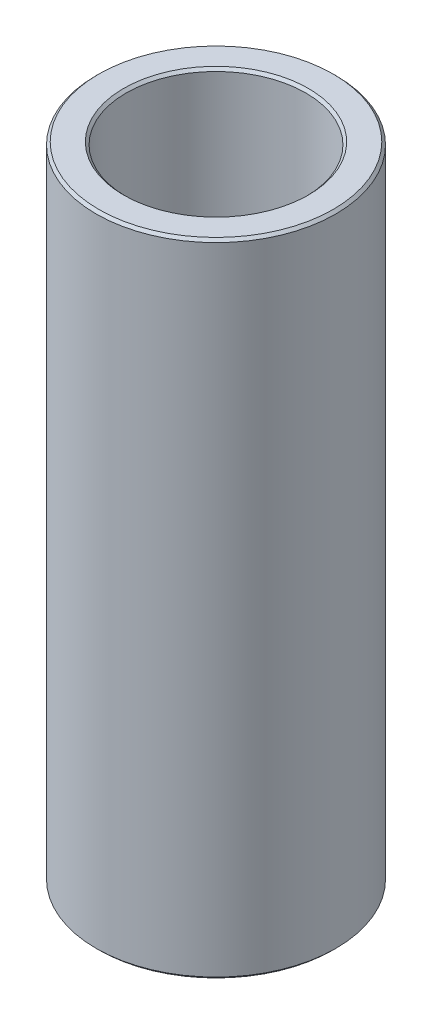
ISO-10303-21;
HEADER;
FILE_DESCRIPTION(('STEP AP214'),'2;1');
FILE_NAME('part.step','',(''),(''),'','','');
FILE_SCHEMA(('AUTOMOTIVE_DESIGN { 1 0 10303 214 1 1 1 1 }'));
ENDSEC;
DATA;
#1=APPLICATION_CONTEXT('core data for automotive mechanical design processes');
#2=APPLICATION_PROTOCOL_DEFINITION('international standard','automotive_design',2000,#1);
#3=PRODUCT_CONTEXT('',#1,'mechanical');
#4=PRODUCT('Part','Part','',(#3));
#5=PRODUCT_RELATED_PRODUCT_CATEGORY('part','',(#4));
#6=PRODUCT_DEFINITION_FORMATION('','',#4);
#7=PRODUCT_DEFINITION_CONTEXT('part definition',#1,'design');
#8=PRODUCT_DEFINITION('design','',#6,#7);
#9=PRODUCT_DEFINITION_SHAPE('','',#8);
#10=(LENGTH_UNIT() NAMED_UNIT(*) SI_UNIT(.MILLI.,.METRE.));
#11=(NAMED_UNIT(*) PLANE_ANGLE_UNIT() SI_UNIT($,.RADIAN.));
#12=(NAMED_UNIT(*) SI_UNIT($,.STERADIAN.) SOLID_ANGLE_UNIT());
#13=UNCERTAINTY_MEASURE_WITH_UNIT(LENGTH_MEASURE(1.E-05),#10,'distance_accuracy_value','');
#14=(GEOMETRIC_REPRESENTATION_CONTEXT(3) GLOBAL_UNCERTAINTY_ASSIGNED_CONTEXT((#13)) GLOBAL_UNIT_ASSIGNED_CONTEXT((#10,
#11,#12)) REPRESENTATION_CONTEXT('',''));
#15=CARTESIAN_POINT('',(0.,0.,0.));
#16=DIRECTION('',(0.,0.,1.));
#17=DIRECTION('',(1.,0.,0.));
#18=AXIS2_PLACEMENT_3D('',#15,#16,#17);
#19=CARTESIAN_POINT('',(0.,214.009140005324,0.));
#20=DIRECTION('',(0.,-1.,0.));
#21=DIRECTION('',(0.,0.,-1.));
#22=AXIS2_PLACEMENT_3D('',#19,#20,#21);
#23=CYLINDRICAL_SURFACE('',#22,40.);
#24=CARTESIAN_POINT('',(0.,0.874469643293796,0.));
#25=DIRECTION('',(0.,1.,0.));
#26=DIRECTION('',(0.,0.,1.));
#27=AXIS2_PLACEMENT_3D('',#24,#25,#26);
#28=CIRCLE('',#27,40.);
#29=CARTESIAN_POINT('',(0.,0.874469643293768,-40.));
#30=VERTEX_POINT('',#29);
#31=EDGE_CURVE('E10',#30,#30,#28,.T.);
#32=CARTESIAN_POINT('',(0.,213.13467036203,0.));
#33=DIRECTION('',(0.,1.,0.));
#34=DIRECTION('',(0.,0.,1.));
#35=AXIS2_PLACEMENT_3D('',#32,#33,#34);
#36=CIRCLE('',#35,40.);
#37=CARTESIAN_POINT('',(0.,213.13467036203,-40.));
#38=VERTEX_POINT('',#37);
#39=EDGE_CURVE('E50',#38,#38,#36,.F.);
#40=CARTESIAN_POINT('',(0.,0.874469643293768,-40.));
#41=CARTESIAN_POINT('',(0.,3.08551340078061,-40.));
#42=CARTESIAN_POINT('',(0.,5.29655715826744,-40.));
#43=CARTESIAN_POINT('',(0.,9.71864467324112,-40.));
#44=CARTESIAN_POINT('',(0.,11.929688430728,-40.));
#45=CARTESIAN_POINT('',(0.,16.3517759457016,-40.));
#46=CARTESIAN_POINT('',(0.,18.5628197031885,-40.));
#47=CARTESIAN_POINT('',(0.,22.9849072181621,-40.));
#48=CARTESIAN_POINT('',(0.,25.195950975649,-40.));
#49=CARTESIAN_POINT('',(0.,29.6180384906227,-40.));
#50=CARTESIAN_POINT('',(0.,31.8290822481095,-40.));
#51=CARTESIAN_POINT('',(0.,36.2511697630832,-40.));
#52=CARTESIAN_POINT('',(0.,38.46221352057,-40.));
#53=CARTESIAN_POINT('',(0.,42.8843010355437,-40.));
#54=CARTESIAN_POINT('',(0.,45.0953447930305,-40.));
#55=CARTESIAN_POINT('',(0.,49.5174323080042,-40.));
#56=CARTESIAN_POINT('',(0.,51.728476065491,-40.));
#57=CARTESIAN_POINT('',(0.,56.1505635804647,-40.));
#58=CARTESIAN_POINT('',(0.,58.3616073379515,-40.));
#59=CARTESIAN_POINT('',(0.,62.7836948529252,-40.));
#60=CARTESIAN_POINT('',(0.,64.9947386104121,-40.));
#61=CARTESIAN_POINT('',(0.,69.4168261253857,-40.));
#62=CARTESIAN_POINT('',(0.,71.6278698828726,-40.));
#63=CARTESIAN_POINT('',(0.,76.0499573978462,-40.));
#64=CARTESIAN_POINT('',(0.,78.2610011553331,-40.));
#65=CARTESIAN_POINT('',(0.,82.6830886703067,-40.));
#66=CARTESIAN_POINT('',(0.,84.8941324277936,-40.));
#67=CARTESIAN_POINT('',(0.,89.3162199427672,-40.));
#68=CARTESIAN_POINT('',(0.,91.5272637002541,-40.));
#69=CARTESIAN_POINT('',(0.,95.9493512152277,-40.));
#70=CARTESIAN_POINT('',(0.,98.1603949727146,-40.));
#71=CARTESIAN_POINT('',(0.,102.582482487688,-40.));
#72=CARTESIAN_POINT('',(0.,104.793526245175,-40.));
#73=CARTESIAN_POINT('',(0.,109.215613760149,-40.));
#74=CARTESIAN_POINT('',(0.,111.426657517636,-40.));
#75=CARTESIAN_POINT('',(0.,115.848745032609,-40.));
#76=CARTESIAN_POINT('',(0.,118.059788790096,-40.));
#77=CARTESIAN_POINT('',(0.,122.48187630507,-40.));
#78=CARTESIAN_POINT('',(0.,124.692920062557,-40.));
#79=CARTESIAN_POINT('',(0.,129.11500757753,-40.));
#80=CARTESIAN_POINT('',(0.,131.326051335017,-40.));
#81=CARTESIAN_POINT('',(0.,135.748138849991,-40.));
#82=CARTESIAN_POINT('',(0.,137.959182607478,-40.));
#83=CARTESIAN_POINT('',(0.,142.381270122451,-40.));
#84=CARTESIAN_POINT('',(0.,144.592313879938,-40.));
#85=CARTESIAN_POINT('',(0.,149.014401394912,-40.));
#86=CARTESIAN_POINT('',(0.,151.225445152399,-40.));
#87=CARTESIAN_POINT('',(0.,155.647532667372,-40.));
#88=CARTESIAN_POINT('',(0.,157.858576424859,-40.));
#89=CARTESIAN_POINT('',(0.,162.280663939833,-40.));
#90=CARTESIAN_POINT('',(0.,164.49170769732,-40.));
#91=CARTESIAN_POINT('',(0.,168.913795212293,-40.));
#92=CARTESIAN_POINT('',(0.,171.12483896978,-40.));
#93=CARTESIAN_POINT('',(0.,175.546926484754,-40.));
#94=CARTESIAN_POINT('',(0.,177.757970242241,-40.));
#95=CARTESIAN_POINT('',(0.,182.180057757214,-40.));
#96=CARTESIAN_POINT('',(0.,184.391101514701,-40.));
#97=CARTESIAN_POINT('',(0.,188.813189029675,-40.));
#98=CARTESIAN_POINT('',(0.,191.024232787162,-40.));
#99=CARTESIAN_POINT('',(0.,195.446320302135,-40.));
#100=CARTESIAN_POINT('',(0.,197.657364059622,-40.));
#101=CARTESIAN_POINT('',(0.,202.079451574596,-40.));
#102=CARTESIAN_POINT('',(0.,204.290495332083,-40.));
#103=CARTESIAN_POINT('',(0.,208.712582847056,-40.));
#104=CARTESIAN_POINT('',(0.,210.923626604543,-40.));
#105=CARTESIAN_POINT('',(0.,213.13467036203,-40.));
#106=B_SPLINE_CURVE_WITH_KNOTS('',3,(#40,#41,#42,#43,#44,#45,#46,#47,#48,#49,#50,#51,#52,#53,
#54,#55,#56,#57,#58,#59,#60,#61,#62,#63,#64,#65,#66,#67,#68,#69,#70,#71,#72,#73,#74,#75,#76,#77,
#78,#79,#80,#81,#82,#83,#84,#85,#86,#87,#88,#89,#90,#91,#92,#93,#94,#95,#96,#97,#98,#99,#100,
#101,#102,#103,#104,#105),.UNSPECIFIED.,.F.,.F.,(4,2,2,2,2,2,2,2,2,2,2,2,2,2,2,2,2,2,2,2,2,2,2,
2,2,2,2,2,2,2,2,2,4),(0.,6.63313127246051,13.266262544921,19.8993938173815,26.5325250898421,
33.1656563623026,39.7987876347631,46.4319189072236,53.0650501796841,59.6981814521446,
66.3313127246051,72.9644439970656,79.5975752695261,86.2307065419866,92.8638378144471,
99.4969690869077,106.130100359368,112.763231631829,119.396362904289,126.02949417675,
132.66262544921,139.295756721671,145.928887994131,152.562019266592,159.195150539052,
165.828281811513,172.461413083973,179.094544356434,185.727675628894,192.360806901355,
198.993938173815,205.627069446276,212.260200718736),.UNSPECIFIED.);
#107=EDGE_CURVE('BSEAM39',#30,#38,#106,.T.);
#108=ORIENTED_EDGE('',*,*,#31,.T.);
#109=ORIENTED_EDGE('',*,*,#39,.T.);
#110=ORIENTED_EDGE('',*,*,#107,.T.);
#111=ORIENTED_EDGE('',*,*,#107,.F.);
#112=EDGE_LOOP('',(#108,#110,#109,#111));
#113=FACE_BOUND('',#112,.T.);
#114=ADVANCED_FACE('F39',(#113),#23,.T.);
#115=CARTESIAN_POINT('',(0.,214.009140005324,0.));
#116=DIRECTION('',(0.,1.,0.));
#117=DIRECTION('',(0.,0.,1.));
#118=AXIS2_PLACEMENT_3D('',#115,#116,#117);
#119=PLANE('',#118);
#120=CARTESIAN_POINT('',(0.,214.009140005324,0.));
#121=DIRECTION('',(0.,1.,0.));
#122=DIRECTION('',(0.,0.,1.));
#123=AXIS2_PLACEMENT_3D('',#120,#121,#122);
#124=CIRCLE('',#123,30.8375517734043);
#125=CARTESIAN_POINT('',(0.,214.009140005324,30.8375517734043));
#126=VERTEX_POINT('',#125);
#127=EDGE_CURVE('E58',#126,#126,#124,.F.);
#128=ORIENTED_EDGE('',*,*,#127,.T.);
#129=EDGE_LOOP('',(#128));
#130=FACE_BOUND('',#129,.T.);
#131=CARTESIAN_POINT('',(0.,214.009140005324,0.));
#132=DIRECTION('',(0.,1.,0.));
#133=DIRECTION('',(0.,0.,1.));
#134=AXIS2_PLACEMENT_3D('',#131,#132,#133);
#135=CIRCLE('',#134,39.1255303567064);
#136=CARTESIAN_POINT('',(0.,214.009140005324,39.1255303567064));
#137=VERTEX_POINT('',#136);
#138=EDGE_CURVE('E61',#137,#137,#135,.T.);
#139=ORIENTED_EDGE('',*,*,#138,.T.);
#140=EDGE_LOOP('',(#139));
#141=FACE_BOUND('',#140,.T.);
#142=ADVANCED_FACE('F88',(#130,#141),#119,.T.);
#143=CARTESIAN_POINT('',(0.,0.,0.));
#144=DIRECTION('',(0.,1.,0.));
#145=DIRECTION('',(0.,0.,1.));
#146=AXIS2_PLACEMENT_3D('',#143,#144,#145);
#147=PLANE('',#146);
#148=CARTESIAN_POINT('',(0.,0.,0.));
#149=DIRECTION('',(0.,1.,0.));
#150=DIRECTION('',(0.,0.,1.));
#151=AXIS2_PLACEMENT_3D('',#148,#149,#150);
#152=CIRCLE('',#151,30.8375517734042);
#153=CARTESIAN_POINT('',(0.,0.,30.8375517734042));
#154=VERTEX_POINT('',#153);
#155=EDGE_CURVE('E51',#154,#154,#152,.T.);
#156=ORIENTED_EDGE('',*,*,#155,.T.);
#157=EDGE_LOOP('',(#156));
#158=FACE_BOUND('',#157,.T.);
#159=CARTESIAN_POINT('',(0.,0.,0.));
#160=DIRECTION('',(0.,1.,0.));
#161=DIRECTION('',(0.,0.,1.));
#162=AXIS2_PLACEMENT_3D('',#159,#160,#161);
#163=CIRCLE('',#162,39.1255303567062);
#164=CARTESIAN_POINT('',(0.,0.,39.1255303567062));
#165=VERTEX_POINT('',#164);
#166=EDGE_CURVE('E54',#165,#165,#163,.F.);
#167=ORIENTED_EDGE('',*,*,#166,.T.);
#168=EDGE_LOOP('',(#167));
#169=FACE_BOUND('',#168,.T.);
#170=ADVANCED_FACE('F83',(#158,#169),#147,.F.);
#171=CARTESIAN_POINT('',(0.,214.009140005324,0.));
#172=DIRECTION('',(0.,-1.,0.));
#173=DIRECTION('',(0.,0.,-1.));
#174=AXIS2_PLACEMENT_3D('',#171,#172,#173);
#175=CYLINDRICAL_SURFACE('',#174,29.9630821301105);
#176=CARTESIAN_POINT('',(0.,213.13467036203,0.));
#177=DIRECTION('',(0.,1.,0.));
#178=DIRECTION('',(0.,0.,1.));
#179=AXIS2_PLACEMENT_3D('',#176,#177,#178);
#180=CIRCLE('',#179,29.9630821301105);
#181=CARTESIAN_POINT('',(0.,213.13467036203,-29.9630821301105));
#182=VERTEX_POINT('',#181);
#183=EDGE_CURVE('E67',#182,#182,#180,.T.);
#184=CARTESIAN_POINT('',(0.,0.874469643293657,0.));
#185=DIRECTION('',(0.,1.,0.));
#186=DIRECTION('',(0.,0.,1.));
#187=AXIS2_PLACEMENT_3D('',#184,#185,#186);
#188=CIRCLE('',#187,29.9630821301105);
#189=CARTESIAN_POINT('',(0.,0.874469643293657,-29.9630821301105));
#190=VERTEX_POINT('',#189);
#191=EDGE_CURVE('E69',#190,#190,#188,.F.);
#192=CARTESIAN_POINT('',(0.,213.13467036203,-29.9630821301105));
#193=CARTESIAN_POINT('',(0.,210.923626604543,-29.9630821301105));
#194=CARTESIAN_POINT('',(0.,208.712582847056,-29.9630821301105));
#195=CARTESIAN_POINT('',(0.,204.290495332083,-29.9630821301105));
#196=CARTESIAN_POINT('',(0.,202.079451574596,-29.9630821301105));
#197=CARTESIAN_POINT('',(0.,197.657364059622,-29.9630821301105));
#198=CARTESIAN_POINT('',(0.,195.446320302135,-29.9630821301105));
#199=CARTESIAN_POINT('',(0.,191.024232787162,-29.9630821301105));
#200=CARTESIAN_POINT('',(0.,188.813189029675,-29.9630821301105));
#201=CARTESIAN_POINT('',(0.,184.391101514701,-29.9630821301105));
#202=CARTESIAN_POINT('',(0.,182.180057757214,-29.9630821301105));
#203=CARTESIAN_POINT('',(0.,177.757970242241,-29.9630821301105));
#204=CARTESIAN_POINT('',(0.,175.546926484754,-29.9630821301105));
#205=CARTESIAN_POINT('',(0.,171.12483896978,-29.9630821301105));
#206=CARTESIAN_POINT('',(0.,168.913795212293,-29.9630821301105));
#207=CARTESIAN_POINT('',(0.,164.49170769732,-29.9630821301105));
#208=CARTESIAN_POINT('',(0.,162.280663939833,-29.9630821301105));
#209=CARTESIAN_POINT('',(0.,157.858576424859,-29.9630821301105));
#210=CARTESIAN_POINT('',(0.,155.647532667372,-29.9630821301105));
#211=CARTESIAN_POINT('',(0.,151.225445152399,-29.9630821301105));
#212=CARTESIAN_POINT('',(0.,149.014401394912,-29.9630821301105));
#213=CARTESIAN_POINT('',(0.,144.592313879938,-29.9630821301105));
#214=CARTESIAN_POINT('',(0.,142.381270122451,-29.9630821301105));
#215=CARTESIAN_POINT('',(0.,137.959182607478,-29.9630821301105));
#216=CARTESIAN_POINT('',(0.,135.748138849991,-29.9630821301105));
#217=CARTESIAN_POINT('',(0.,131.326051335017,-29.9630821301105));
#218=CARTESIAN_POINT('',(0.,129.11500757753,-29.9630821301105));
#219=CARTESIAN_POINT('',(0.,124.692920062557,-29.9630821301105));
#220=CARTESIAN_POINT('',(0.,122.48187630507,-29.9630821301105));
#221=CARTESIAN_POINT('',(0.,118.059788790096,-29.9630821301105));
#222=CARTESIAN_POINT('',(0.,115.848745032609,-29.9630821301105));
#223=CARTESIAN_POINT('',(0.,111.426657517636,-29.9630821301105));
#224=CARTESIAN_POINT('',(0.,109.215613760149,-29.9630821301105));
#225=CARTESIAN_POINT('',(0.,104.793526245175,-29.9630821301105));
#226=CARTESIAN_POINT('',(0.,102.582482487688,-29.9630821301105));
#227=CARTESIAN_POINT('',(0.,98.1603949727145,-29.9630821301105));
#228=CARTESIAN_POINT('',(0.,95.9493512152276,-29.9630821301105));
#229=CARTESIAN_POINT('',(0.,91.527263700254,-29.9630821301105));
#230=CARTESIAN_POINT('',(0.,89.3162199427671,-29.9630821301105));
#231=CARTESIAN_POINT('',(0.,84.8941324277935,-29.9630821301105));
#232=CARTESIAN_POINT('',(0.,82.6830886703066,-29.9630821301105));
#233=CARTESIAN_POINT('',(0.,78.2610011553329,-29.9630821301105));
#234=CARTESIAN_POINT('',(0.,76.0499573978461,-29.9630821301105));
#235=CARTESIAN_POINT('',(0.,71.6278698828724,-29.9630821301105));
#236=CARTESIAN_POINT('',(0.,69.4168261253856,-29.9630821301105));
#237=CARTESIAN_POINT('',(0.,64.9947386104119,-29.9630821301105));
#238=CARTESIAN_POINT('',(0.,62.7836948529251,-29.9630821301105));
#239=CARTESIAN_POINT('',(0.,58.3616073379514,-29.9630821301105));
#240=CARTESIAN_POINT('',(0.,56.1505635804646,-29.9630821301105));
#241=CARTESIAN_POINT('',(0.,51.7284760654909,-29.9630821301105));
#242=CARTESIAN_POINT('',(0.,49.5174323080041,-29.9630821301105));
#243=CARTESIAN_POINT('',(0.,45.0953447930304,-29.9630821301105));
#244=CARTESIAN_POINT('',(0.,42.8843010355435,-29.9630821301105));
#245=CARTESIAN_POINT('',(0.,38.4622135205699,-29.9630821301105));
#246=CARTESIAN_POINT('',(0.,36.251169763083,-29.9630821301105));
#247=CARTESIAN_POINT('',(0.,31.8290822481094,-29.9630821301105));
#248=CARTESIAN_POINT('',(0.,29.6180384906225,-29.9630821301105));
#249=CARTESIAN_POINT('',(0.,25.1959509756489,-29.9630821301105));
#250=CARTESIAN_POINT('',(0.,22.984907218162,-29.9630821301105));
#251=CARTESIAN_POINT('',(0.,18.5628197031884,-29.9630821301105));
#252=CARTESIAN_POINT('',(0.,16.3517759457015,-29.9630821301105));
#253=CARTESIAN_POINT('',(0.,11.9296884307278,-29.9630821301105));
#254=CARTESIAN_POINT('',(0.,9.71864467324101,-29.9630821301105));
#255=CARTESIAN_POINT('',(0.,5.29655715826733,-29.9630821301105));
#256=CARTESIAN_POINT('',(0.,3.0855134007805,-29.9630821301105));
#257=CARTESIAN_POINT('',(0.,0.874469643293657,-29.9630821301105));
#258=B_SPLINE_CURVE_WITH_KNOTS('',3,(#192,#193,#194,#195,#196,#197,#198,#199,#200,#201,#202,
#203,#204,#205,#206,#207,#208,#209,#210,#211,#212,#213,#214,#215,#216,#217,#218,#219,#220,#221,
#222,#223,#224,#225,#226,#227,#228,#229,#230,#231,#232,#233,#234,#235,#236,#237,#238,#239,#240,
#241,#242,#243,#244,#245,#246,#247,#248,#249,#250,#251,#252,#253,#254,#255,#256,#257),
.UNSPECIFIED.,.F.,.F.,(4,2,2,2,2,2,2,2,2,2,2,2,2,2,2,2,2,2,2,2,2,2,2,2,2,2,2,2,2,2,2,2,4),(0.,
6.63313127246048,13.266262544921,19.8993938173815,26.532525089842,33.1656563623025,
39.7987876347631,46.4319189072236,53.0650501796841,59.6981814521446,66.3313127246051,
72.9644439970656,79.5975752695261,86.2307065419866,92.8638378144471,99.4969690869076,
106.130100359368,112.763231631829,119.396362904289,126.02949417675,132.66262544921,
139.295756721671,145.928887994131,152.562019266592,159.195150539052,165.828281811513,
172.461413083973,179.094544356434,185.727675628894,192.360806901355,198.993938173815,
205.627069446276,212.260200718736),.UNSPECIFIED.);
#259=EDGE_CURVE('BSEAM71',#182,#190,#258,.T.);
#260=ORIENTED_EDGE('',*,*,#183,.T.);
#261=ORIENTED_EDGE('',*,*,#191,.T.);
#262=ORIENTED_EDGE('',*,*,#259,.T.);
#263=ORIENTED_EDGE('',*,*,#259,.F.);
#264=EDGE_LOOP('',(#260,#262,#261,#263));
#265=FACE_BOUND('',#264,.T.);
#266=ADVANCED_FACE('F71',(#265),#175,.F.);
#267=CARTESIAN_POINT('',(0.,213.13467036203,0.));
#268=DIRECTION('',(0.,1.,0.));
#269=DIRECTION('',(0.,0.,1.));
#270=AXIS2_PLACEMENT_3D('',#267,#268,#269);
#271=CONICAL_SURFACE('',#270,29.9630821301105,0.785398163397444);
#272=ORIENTED_EDGE('',*,*,#127,.F.);
#273=EDGE_LOOP('',(#272));
#274=FACE_BOUND('',#273,.T.);
#275=ORIENTED_EDGE('',*,*,#183,.F.);
#276=EDGE_LOOP('',(#275));
#277=FACE_BOUND('',#276,.T.);
#278=ADVANCED_FACE('F77',(#274,#277),#271,.F.);
#279=CARTESIAN_POINT('',(0.,0.,0.));
#280=DIRECTION('',(0.,-1.,0.));
#281=DIRECTION('',(0.,0.,-1.));
#282=AXIS2_PLACEMENT_3D('',#279,#280,#281);
#283=CONICAL_SURFACE('',#282,30.8375517734042,0.78539816339746);
#284=ORIENTED_EDGE('',*,*,#191,.F.);
#285=EDGE_LOOP('',(#284));
#286=FACE_BOUND('',#285,.T.);
#287=ORIENTED_EDGE('',*,*,#155,.F.);
#288=EDGE_LOOP('',(#287));
#289=FACE_BOUND('',#288,.T.);
#290=ADVANCED_FACE('F73',(#286,#289),#283,.F.);
#291=CARTESIAN_POINT('',(0.,0.874469643293796,0.));
#292=DIRECTION('',(0.,1.,0.));
#293=DIRECTION('',(0.,0.,1.));
#294=AXIS2_PLACEMENT_3D('',#291,#292,#293);
#295=CONICAL_SURFACE('',#294,40.,0.785398163397448);
#296=ORIENTED_EDGE('',*,*,#166,.F.);
#297=EDGE_LOOP('',(#296));
#298=FACE_BOUND('',#297,.T.);
#299=ORIENTED_EDGE('',*,*,#31,.F.);
#300=EDGE_LOOP('',(#299));
#301=FACE_BOUND('',#300,.T.);
#302=ADVANCED_FACE('F76',(#298,#301),#295,.T.);
#303=CARTESIAN_POINT('',(0.,214.009140005324,0.));
#304=DIRECTION('',(0.,-1.,0.));
#305=DIRECTION('',(0.,0.,-1.));
#306=AXIS2_PLACEMENT_3D('',#303,#304,#305);
#307=CONICAL_SURFACE('',#306,39.1255303567064,0.785398163397448);
#308=ORIENTED_EDGE('',*,*,#39,.F.);
#309=EDGE_LOOP('',(#308));
#310=FACE_BOUND('',#309,.T.);
#311=ORIENTED_EDGE('',*,*,#138,.F.);
#312=EDGE_LOOP('',(#311));
#313=FACE_BOUND('',#312,.T.);
#314=ADVANCED_FACE('F45',(#310,#313),#307,.T.);
#315=CLOSED_SHELL('',(#114,#142,#170,#266,#278,#290,#302,#314));
#316=MANIFOLD_SOLID_BREP('B2',#315);
#317=ADVANCED_BREP_SHAPE_REPRESENTATION('',(#18,#316),#14);
#318=SHAPE_DEFINITION_REPRESENTATION(#9,#317);
ENDSEC;
END-ISO-10303-21;
